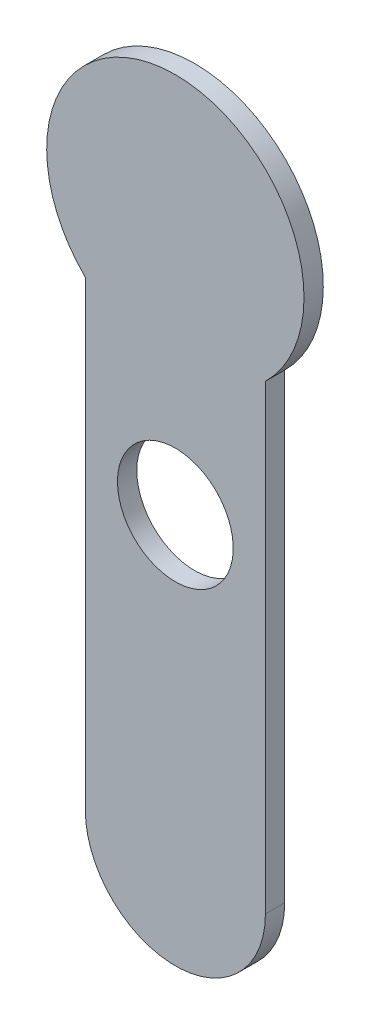
ISO-10303-21;
HEADER;
FILE_DESCRIPTION(('STEP AP214'),'2;1');
FILE_NAME('part.step','',(''),(''),'','','');
FILE_SCHEMA(('AUTOMOTIVE_DESIGN { 1 0 10303 214 1 1 1 1 }'));
ENDSEC;
DATA;
#1=APPLICATION_CONTEXT('core data for automotive mechanical design processes');
#2=APPLICATION_PROTOCOL_DEFINITION('international standard','automotive_design',2000,#1);
#3=PRODUCT_CONTEXT('',#1,'mechanical');
#4=PRODUCT('Part','Part','',(#3));
#5=PRODUCT_RELATED_PRODUCT_CATEGORY('part','',(#4));
#6=PRODUCT_DEFINITION_FORMATION('','',#4);
#7=PRODUCT_DEFINITION_CONTEXT('part definition',#1,'design');
#8=PRODUCT_DEFINITION('design','',#6,#7);
#9=PRODUCT_DEFINITION_SHAPE('','',#8);
#10=(LENGTH_UNIT() NAMED_UNIT(*) SI_UNIT(.MILLI.,.METRE.));
#11=(NAMED_UNIT(*) PLANE_ANGLE_UNIT() SI_UNIT($,.RADIAN.));
#12=(NAMED_UNIT(*) SI_UNIT($,.STERADIAN.) SOLID_ANGLE_UNIT());
#13=UNCERTAINTY_MEASURE_WITH_UNIT(LENGTH_MEASURE(1.E-05),#10,'distance_accuracy_value','');
#14=(GEOMETRIC_REPRESENTATION_CONTEXT(3) GLOBAL_UNCERTAINTY_ASSIGNED_CONTEXT((#13)) GLOBAL_UNIT_ASSIGNED_CONTEXT((#10,
#11,#12)) REPRESENTATION_CONTEXT('',''));
#15=CARTESIAN_POINT('',(0.,0.,0.));
#16=DIRECTION('',(0.,0.,1.));
#17=DIRECTION('',(1.,0.,0.));
#18=AXIS2_PLACEMENT_3D('',#15,#16,#17);
#19=CARTESIAN_POINT('',(0.,-4.50262317199779,0.));
#20=DIRECTION('',(0.,0.,1.));
#21=DIRECTION('',(1.,0.,0.));
#22=AXIS2_PLACEMENT_3D('',#19,#20,#21);
#23=PLANE('',#22);
#24=CARTESIAN_POINT('',(0.,-3.92828568570857,0.));
#25=DIRECTION('',(0.,0.,-1.));
#26=DIRECTION('',(-1.,0.,0.));
#27=AXIS2_PLACEMENT_3D('',#24,#25,#26);
#28=CIRCLE('',#27,0.9);
#29=CARTESIAN_POINT('',(-0.9,-3.92828568570857,0.));
#30=VERTEX_POINT('',#29);
#31=EDGE_CURVE('E73',#30,#30,#28,.F.);
#32=ORIENTED_EDGE('',*,*,#31,.T.);
#33=EDGE_LOOP('',(#32));
#34=FACE_BOUND('',#33,.T.);
#35=DIRECTION('',(0.,1.,0.));
#36=VECTOR('',#35,1.);
#37=CARTESIAN_POINT('',(-1.4,-1.42828568570857,0.));
#38=LINE('',#37,#36);
#39=CARTESIAN_POINT('',(-1.4,-1.42828568570857,0.));
#40=VERTEX_POINT('',#39);
#41=CARTESIAN_POINT('',(-1.4,-8.6,0.));
#42=VERTEX_POINT('',#41);
#43=EDGE_CURVE('E57',#40,#42,#38,.F.);
#44=ORIENTED_EDGE('',*,*,#43,.F.);
#45=CARTESIAN_POINT('',(0.,0.,0.));
#46=DIRECTION('',(0.,0.,1.));
#47=DIRECTION('',(1.,0.,0.));
#48=AXIS2_PLACEMENT_3D('',#45,#46,#47);
#49=CIRCLE('',#48,2.);
#50=CARTESIAN_POINT('',(1.4,-1.42828568570857,0.));
#51=VERTEX_POINT('',#50);
#52=EDGE_CURVE('E81',#51,#40,#49,.T.);
#53=ORIENTED_EDGE('',*,*,#52,.F.);
#54=DIRECTION('',(0.,1.,0.));
#55=VECTOR('',#54,1.);
#56=CARTESIAN_POINT('',(1.4,-10.,0.));
#57=LINE('',#56,#55);
#58=CARTESIAN_POINT('',(1.4,-8.6,0.));
#59=VERTEX_POINT('',#58);
#60=EDGE_CURVE('E59',#59,#51,#57,.T.);
#61=ORIENTED_EDGE('',*,*,#60,.F.);
#62=CARTESIAN_POINT('',(0.,-8.6,0.));
#63=DIRECTION('',(0.,0.,1.));
#64=DIRECTION('',(1.,0.,0.));
#65=AXIS2_PLACEMENT_3D('',#62,#63,#64);
#66=CIRCLE('',#65,1.4);
#67=EDGE_CURVE('E19',#42,#59,#66,.T.);
#68=ORIENTED_EDGE('',*,*,#67,.F.);
#69=EDGE_LOOP('',(#44,#53,#61,#68));
#70=FACE_BOUND('',#69,.T.);
#71=ADVANCED_FACE('F16',(#34,#70),#23,.F.);
#72=CARTESIAN_POINT('',(0.,-8.6,0.));
#73=DIRECTION('',(0.,0.,1.));
#74=DIRECTION('',(1.,0.,0.));
#75=AXIS2_PLACEMENT_3D('',#72,#73,#74);
#76=CYLINDRICAL_SURFACE('',#75,1.4);
#77=ORIENTED_EDGE('',*,*,#67,.T.);
#78=DIRECTION('',(0.,0.,-1.));
#79=VECTOR('',#78,1.);
#80=CARTESIAN_POINT('',(1.4,-8.6,0.));
#81=LINE('',#80,#79);
#82=CARTESIAN_POINT('',(1.4,-8.6,0.3));
#83=VERTEX_POINT('',#82);
#84=EDGE_CURVE('E62',#83,#59,#81,.T.);
#85=ORIENTED_EDGE('',*,*,#84,.F.);
#86=CARTESIAN_POINT('',(0.,-8.6,0.3));
#87=DIRECTION('',(0.,0.,1.));
#88=DIRECTION('',(1.,0.,0.));
#89=AXIS2_PLACEMENT_3D('',#86,#87,#88);
#90=CIRCLE('',#89,1.4);
#91=CARTESIAN_POINT('',(-1.4,-8.6,0.3));
#92=VERTEX_POINT('',#91);
#93=EDGE_CURVE('E67',#92,#83,#90,.T.);
#94=ORIENTED_EDGE('',*,*,#93,.F.);
#95=DIRECTION('',(0.,0.,1.));
#96=VECTOR('',#95,1.);
#97=CARTESIAN_POINT('',(-1.4,-8.6,0.));
#98=LINE('',#97,#96);
#99=EDGE_CURVE('E64',#42,#92,#98,.T.);
#100=ORIENTED_EDGE('',*,*,#99,.F.);
#101=EDGE_LOOP('',(#77,#85,#94,#100));
#102=FACE_BOUND('',#101,.T.);
#103=ADVANCED_FACE('F65',(#102),#76,.T.);
#104=CARTESIAN_POINT('',(1.4,-10.,0.));
#105=DIRECTION('',(1.,0.,0.));
#106=DIRECTION('',(0.,0.,-1.));
#107=AXIS2_PLACEMENT_3D('',#104,#105,#106);
#108=PLANE('',#107);
#109=DIRECTION('',(0.,0.,1.));
#110=VECTOR('',#109,1.);
#111=CARTESIAN_POINT('',(1.4,-1.42828568570857,0.));
#112=LINE('',#111,#110);
#113=CARTESIAN_POINT('',(1.4,-1.42828568570857,0.3));
#114=VERTEX_POINT('',#113);
#115=EDGE_CURVE('E70',#114,#51,#112,.F.);
#116=ORIENTED_EDGE('',*,*,#115,.F.);
#117=DIRECTION('',(0.,1.,0.));
#118=VECTOR('',#117,1.);
#119=CARTESIAN_POINT('',(1.4,-4.50262317199779,0.3));
#120=LINE('',#119,#118);
#121=EDGE_CURVE('E86',#83,#114,#120,.T.);
#122=ORIENTED_EDGE('',*,*,#121,.F.);
#123=ORIENTED_EDGE('',*,*,#84,.T.);
#124=ORIENTED_EDGE('',*,*,#60,.T.);
#125=EDGE_LOOP('',(#116,#122,#123,#124));
#126=FACE_BOUND('',#125,.T.);
#127=ADVANCED_FACE('F96',(#126),#108,.T.);
#128=CARTESIAN_POINT('',(0.,0.,0.));
#129=DIRECTION('',(0.,0.,1.));
#130=DIRECTION('',(1.,0.,0.));
#131=AXIS2_PLACEMENT_3D('',#128,#129,#130);
#132=CYLINDRICAL_SURFACE('',#131,2.);
#133=CARTESIAN_POINT('',(0.,0.,0.3));
#134=DIRECTION('',(0.,0.,1.));
#135=DIRECTION('',(1.,0.,0.));
#136=AXIS2_PLACEMENT_3D('',#133,#134,#135);
#137=CIRCLE('',#136,2.);
#138=CARTESIAN_POINT('',(-1.4,-1.42828568570857,0.3));
#139=VERTEX_POINT('',#138);
#140=EDGE_CURVE('E83',#114,#139,#137,.T.);
#141=ORIENTED_EDGE('',*,*,#140,.F.);
#142=ORIENTED_EDGE('',*,*,#115,.T.);
#143=ORIENTED_EDGE('',*,*,#52,.T.);
#144=DIRECTION('',(0.,0.,1.));
#145=VECTOR('',#144,1.);
#146=CARTESIAN_POINT('',(-1.4,-1.42828568570857,0.));
#147=LINE('',#146,#145);
#148=EDGE_CURVE('E34',#139,#40,#147,.F.);
#149=ORIENTED_EDGE('',*,*,#148,.F.);
#150=EDGE_LOOP('',(#141,#142,#143,#149));
#151=FACE_BOUND('',#150,.T.);
#152=ADVANCED_FACE('F94',(#151),#132,.T.);
#153=CARTESIAN_POINT('',(-1.4,-1.42828568570857,0.));
#154=DIRECTION('',(-1.,0.,0.));
#155=DIRECTION('',(0.,0.,1.));
#156=AXIS2_PLACEMENT_3D('',#153,#154,#155);
#157=PLANE('',#156);
#158=ORIENTED_EDGE('',*,*,#148,.T.);
#159=ORIENTED_EDGE('',*,*,#43,.T.);
#160=ORIENTED_EDGE('',*,*,#99,.T.);
#161=DIRECTION('',(0.,1.,0.));
#162=VECTOR('',#161,1.);
#163=CARTESIAN_POINT('',(-1.4,-4.50262317199779,0.3));
#164=LINE('',#163,#162);
#165=EDGE_CURVE('E25',#139,#92,#164,.F.);
#166=ORIENTED_EDGE('',*,*,#165,.F.);
#167=EDGE_LOOP('',(#158,#159,#160,#166));
#168=FACE_BOUND('',#167,.T.);
#169=ADVANCED_FACE('F72',(#168),#157,.T.);
#170=CARTESIAN_POINT('',(0.,-3.92828568570857,0.3));
#171=DIRECTION('',(0.,0.,-1.));
#172=DIRECTION('',(-1.,0.,0.));
#173=AXIS2_PLACEMENT_3D('',#170,#171,#172);
#174=CYLINDRICAL_SURFACE('',#173,0.9);
#175=CARTESIAN_POINT('',(0.,-3.92828568570857,0.3));
#176=DIRECTION('',(0.,0.,-1.));
#177=DIRECTION('',(-1.,0.,0.));
#178=AXIS2_PLACEMENT_3D('',#175,#176,#177);
#179=CIRCLE('',#178,0.9);
#180=CARTESIAN_POINT('',(-0.9,-3.92828568570857,0.3));
#181=VERTEX_POINT('',#180);
#182=EDGE_CURVE('E11',#181,#181,#179,.T.);
#183=ORIENTED_EDGE('',*,*,#182,.F.);
#184=EDGE_LOOP('',(#183));
#185=FACE_BOUND('',#184,.T.);
#186=ORIENTED_EDGE('',*,*,#31,.F.);
#187=EDGE_LOOP('',(#186));
#188=FACE_BOUND('',#187,.T.);
#189=ADVANCED_FACE('F103',(#185,#188),#174,.F.);
#190=CARTESIAN_POINT('',(0.,-4.50262317199779,0.3));
#191=DIRECTION('',(0.,0.,1.));
#192=DIRECTION('',(1.,0.,0.));
#193=AXIS2_PLACEMENT_3D('',#190,#191,#192);
#194=PLANE('',#193);
#195=ORIENTED_EDGE('',*,*,#182,.T.);
#196=EDGE_LOOP('',(#195));
#197=FACE_BOUND('',#196,.T.);
#198=ORIENTED_EDGE('',*,*,#140,.T.);
#199=ORIENTED_EDGE('',*,*,#165,.T.);
#200=ORIENTED_EDGE('',*,*,#93,.T.);
#201=ORIENTED_EDGE('',*,*,#121,.T.);
#202=EDGE_LOOP('',(#198,#199,#200,#201));
#203=FACE_BOUND('',#202,.T.);
#204=ADVANCED_FACE('F92',(#197,#203),#194,.T.);
#205=CLOSED_SHELL('',(#71,#103,#127,#152,#169,#189,#204));
#206=MANIFOLD_SOLID_BREP('B1',#205);
#207=ADVANCED_BREP_SHAPE_REPRESENTATION('',(#18,#206),#14);
#208=SHAPE_DEFINITION_REPRESENTATION(#9,#207);
ENDSEC;
END-ISO-10303-21;
